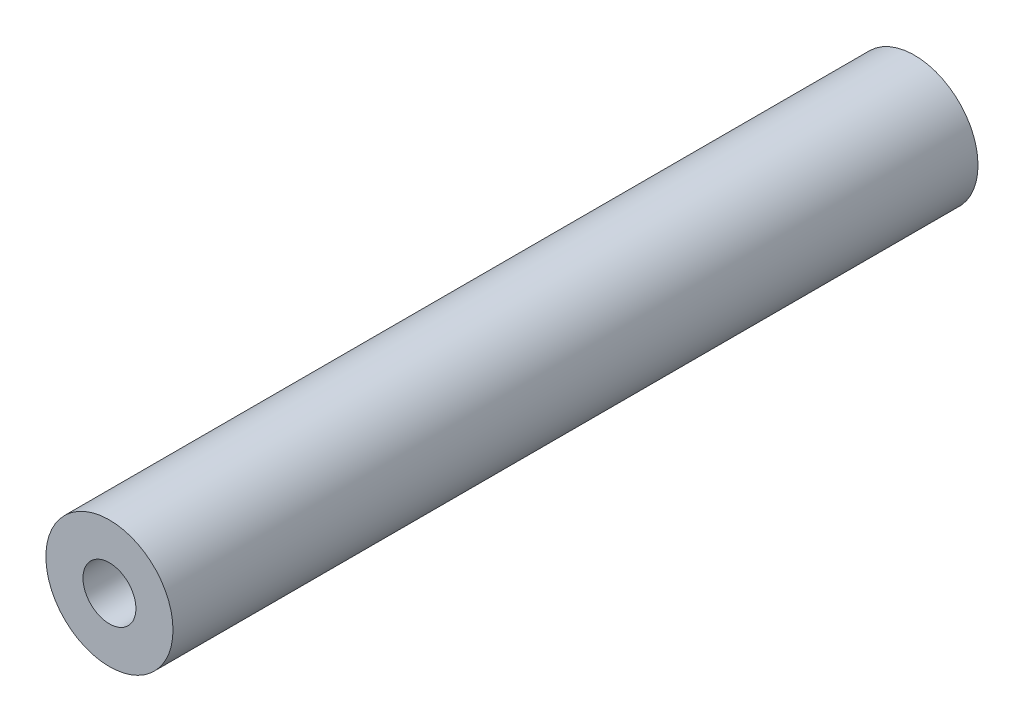
ISO-10303-21;
HEADER;
FILE_DESCRIPTION(('STEP AP214'),'2;1');
FILE_NAME('part.step','',(''),(''),'','','');
FILE_SCHEMA(('AUTOMOTIVE_DESIGN { 1 0 10303 214 1 1 1 1 }'));
ENDSEC;
DATA;
#1=APPLICATION_CONTEXT('core data for automotive mechanical design processes');
#2=APPLICATION_PROTOCOL_DEFINITION('international standard','automotive_design',2000,#1);
#3=PRODUCT_CONTEXT('',#1,'mechanical');
#4=PRODUCT('Part','Part','',(#3));
#5=PRODUCT_RELATED_PRODUCT_CATEGORY('part','',(#4));
#6=PRODUCT_DEFINITION_FORMATION('','',#4);
#7=PRODUCT_DEFINITION_CONTEXT('part definition',#1,'design');
#8=PRODUCT_DEFINITION('design','',#6,#7);
#9=PRODUCT_DEFINITION_SHAPE('','',#8);
#10=(LENGTH_UNIT() NAMED_UNIT(*) SI_UNIT(.MILLI.,.METRE.));
#11=(NAMED_UNIT(*) PLANE_ANGLE_UNIT() SI_UNIT($,.RADIAN.));
#12=(NAMED_UNIT(*) SI_UNIT($,.STERADIAN.) SOLID_ANGLE_UNIT());
#13=UNCERTAINTY_MEASURE_WITH_UNIT(LENGTH_MEASURE(1.E-05),#10,'distance_accuracy_value','');
#14=(GEOMETRIC_REPRESENTATION_CONTEXT(3) GLOBAL_UNCERTAINTY_ASSIGNED_CONTEXT((#13)) GLOBAL_UNIT_ASSIGNED_CONTEXT((#10,
#11,#12)) REPRESENTATION_CONTEXT('',''));
#15=CARTESIAN_POINT('',(0.,0.,0.));
#16=DIRECTION('',(0.,0.,1.));
#17=DIRECTION('',(1.,0.,0.));
#18=AXIS2_PLACEMENT_3D('',#15,#16,#17);
#19=CARTESIAN_POINT('',(0.,0.,76.));
#20=DIRECTION('',(0.,0.,-1.));
#21=DIRECTION('',(-1.,0.,0.));
#22=AXIS2_PLACEMENT_3D('',#19,#20,#21);
#23=CYLINDRICAL_SURFACE('',#22,6.);
#24=CARTESIAN_POINT('',(0.,0.,76.));
#25=DIRECTION('',(0.,0.,1.));
#26=DIRECTION('',(1.,0.,0.));
#27=AXIS2_PLACEMENT_3D('',#24,#25,#26);
#28=CIRCLE('',#27,6.);
#29=CARTESIAN_POINT('',(6.,0.,76.));
#30=VERTEX_POINT('',#29);
#31=EDGE_CURVE('E11',#30,#30,#28,.T.);
#32=ORIENTED_EDGE('',*,*,#31,.F.);
#33=EDGE_LOOP('',(#32));
#34=FACE_BOUND('',#33,.T.);
#35=CARTESIAN_POINT('',(0.,0.,0.));
#36=DIRECTION('',(0.,0.,1.));
#37=DIRECTION('',(1.,0.,0.));
#38=AXIS2_PLACEMENT_3D('',#35,#36,#37);
#39=CIRCLE('',#38,6.);
#40=CARTESIAN_POINT('',(6.,0.,0.));
#41=VERTEX_POINT('',#40);
#42=EDGE_CURVE('E52',#41,#41,#39,.T.);
#43=ORIENTED_EDGE('',*,*,#42,.T.);
#44=EDGE_LOOP('',(#43));
#45=FACE_BOUND('',#44,.T.);
#46=ADVANCED_FACE('F49',(#34,#45),#23,.T.);
#47=CARTESIAN_POINT('',(0.,0.,76.));
#48=DIRECTION('',(0.,0.,1.));
#49=DIRECTION('',(1.,0.,0.));
#50=AXIS2_PLACEMENT_3D('',#47,#48,#49);
#51=PLANE('',#50);
#52=CARTESIAN_POINT('',(0.,0.,76.));
#53=DIRECTION('',(0.,0.,1.));
#54=DIRECTION('',(1.,0.,0.));
#55=AXIS2_PLACEMENT_3D('',#52,#53,#54);
#56=CIRCLE('',#55,2.5);
#57=CARTESIAN_POINT('',(2.5,0.,76.));
#58=VERTEX_POINT('',#57);
#59=EDGE_CURVE('E74',#58,#58,#56,.T.);
#60=ORIENTED_EDGE('',*,*,#59,.F.);
#61=EDGE_LOOP('',(#60));
#62=FACE_BOUND('',#61,.T.);
#63=ORIENTED_EDGE('',*,*,#31,.T.);
#64=EDGE_LOOP('',(#63));
#65=FACE_BOUND('',#64,.T.);
#66=ADVANCED_FACE('F103',(#62,#65),#51,.T.);
#67=CARTESIAN_POINT('',(0.,0.,0.));
#68=DIRECTION('',(0.,0.,1.));
#69=DIRECTION('',(1.,0.,0.));
#70=AXIS2_PLACEMENT_3D('',#67,#68,#69);
#71=PLANE('',#70);
#72=CARTESIAN_POINT('',(0.,0.,0.));
#73=DIRECTION('',(0.,0.,-1.));
#74=DIRECTION('',(-1.,0.,0.));
#75=AXIS2_PLACEMENT_3D('',#72,#73,#74);
#76=CIRCLE('',#75,2.49999999999999);
#77=CARTESIAN_POINT('',(-2.49999999999999,0.,0.));
#78=VERTEX_POINT('',#77);
#79=EDGE_CURVE('E75',#78,#78,#76,.T.);
#80=ORIENTED_EDGE('',*,*,#79,.F.);
#81=EDGE_LOOP('',(#80));
#82=FACE_BOUND('',#81,.T.);
#83=ORIENTED_EDGE('',*,*,#42,.F.);
#84=EDGE_LOOP('',(#83));
#85=FACE_BOUND('',#84,.T.);
#86=ADVANCED_FACE('F100',(#82,#85),#71,.F.);
#87=CARTESIAN_POINT('',(0.,0.,43.));
#88=DIRECTION('',(0.,0.,1.));
#89=DIRECTION('',(1.,0.,0.));
#90=AXIS2_PLACEMENT_3D('',#87,#88,#89);
#91=CONICAL_SURFACE('',#90,2.49999999999999,1.02974425867665);
#92=CARTESIAN_POINT('',(0.,0.,41.4978484524311));
#93=VERTEX_POINT('',#92);
#94=VERTEX_LOOP('',#93);
#95=FACE_BOUND('',#94,.T.);
#96=CARTESIAN_POINT('',(0.,0.,43.));
#97=DIRECTION('',(0.,0.,1.));
#98=DIRECTION('',(1.,0.,0.));
#99=AXIS2_PLACEMENT_3D('',#96,#97,#98);
#100=CIRCLE('',#99,2.49999999999999);
#101=CARTESIAN_POINT('',(2.49999999999999,0.,43.));
#102=VERTEX_POINT('',#101);
#103=EDGE_CURVE('E82',#102,#102,#100,.T.);
#104=ORIENTED_EDGE('',*,*,#103,.T.);
#105=EDGE_LOOP('',(#104));
#106=FACE_BOUND('',#105,.T.);
#107=ADVANCED_FACE('F102',(#95,#106),#91,.F.);
#108=CARTESIAN_POINT('',(0.,0.,76.));
#109=DIRECTION('',(0.,0.,1.));
#110=DIRECTION('',(1.,0.,0.));
#111=AXIS2_PLACEMENT_3D('',#108,#109,#110);
#112=CYLINDRICAL_SURFACE('',#111,2.49999999999999);
#113=ORIENTED_EDGE('',*,*,#103,.F.);
#114=EDGE_LOOP('',(#113));
#115=FACE_BOUND('',#114,.T.);
#116=ORIENTED_EDGE('',*,*,#59,.T.);
#117=EDGE_LOOP('',(#116));
#118=FACE_BOUND('',#117,.T.);
#119=ADVANCED_FACE('F67',(#115,#118),#112,.F.);
#120=CARTESIAN_POINT('',(0.,0.,33.));
#121=DIRECTION('',(0.,0.,-1.));
#122=DIRECTION('',(-1.,0.,0.));
#123=AXIS2_PLACEMENT_3D('',#120,#121,#122);
#124=CONICAL_SURFACE('',#123,2.49999999999998,1.02974425867665);
#125=CARTESIAN_POINT('',(0.,0.,34.5021515475689));
#126=VERTEX_POINT('',#125);
#127=VERTEX_LOOP('',#126);
#128=FACE_BOUND('',#127,.T.);
#129=CARTESIAN_POINT('',(0.,0.,33.));
#130=DIRECTION('',(0.,0.,-1.));
#131=DIRECTION('',(-1.,0.,0.));
#132=AXIS2_PLACEMENT_3D('',#129,#130,#131);
#133=CIRCLE('',#132,2.49999999999998);
#134=CARTESIAN_POINT('',(-2.49999999999998,0.,33.));
#135=VERTEX_POINT('',#134);
#136=EDGE_CURVE('E71',#135,#135,#133,.T.);
#137=ORIENTED_EDGE('',*,*,#136,.T.);
#138=EDGE_LOOP('',(#137));
#139=FACE_BOUND('',#138,.T.);
#140=ADVANCED_FACE('F63',(#128,#139),#124,.F.);
#141=CARTESIAN_POINT('',(0.,0.,0.));
#142=DIRECTION('',(0.,0.,-1.));
#143=DIRECTION('',(-1.,0.,0.));
#144=AXIS2_PLACEMENT_3D('',#141,#142,#143);
#145=CYLINDRICAL_SURFACE('',#144,2.49999999999999);
#146=ORIENTED_EDGE('',*,*,#136,.F.);
#147=EDGE_LOOP('',(#146));
#148=FACE_BOUND('',#147,.T.);
#149=ORIENTED_EDGE('',*,*,#79,.T.);
#150=EDGE_LOOP('',(#149));
#151=FACE_BOUND('',#150,.T.);
#152=ADVANCED_FACE('F66',(#148,#151),#145,.F.);
#153=CLOSED_SHELL('',(#46,#66,#86,#107,#119,#140,#152));
#154=MANIFOLD_SOLID_BREP('B2',#153);
#155=ADVANCED_BREP_SHAPE_REPRESENTATION('',(#18,#154),#14);
#156=SHAPE_DEFINITION_REPRESENTATION(#9,#155);
ENDSEC;
END-ISO-10303-21;
